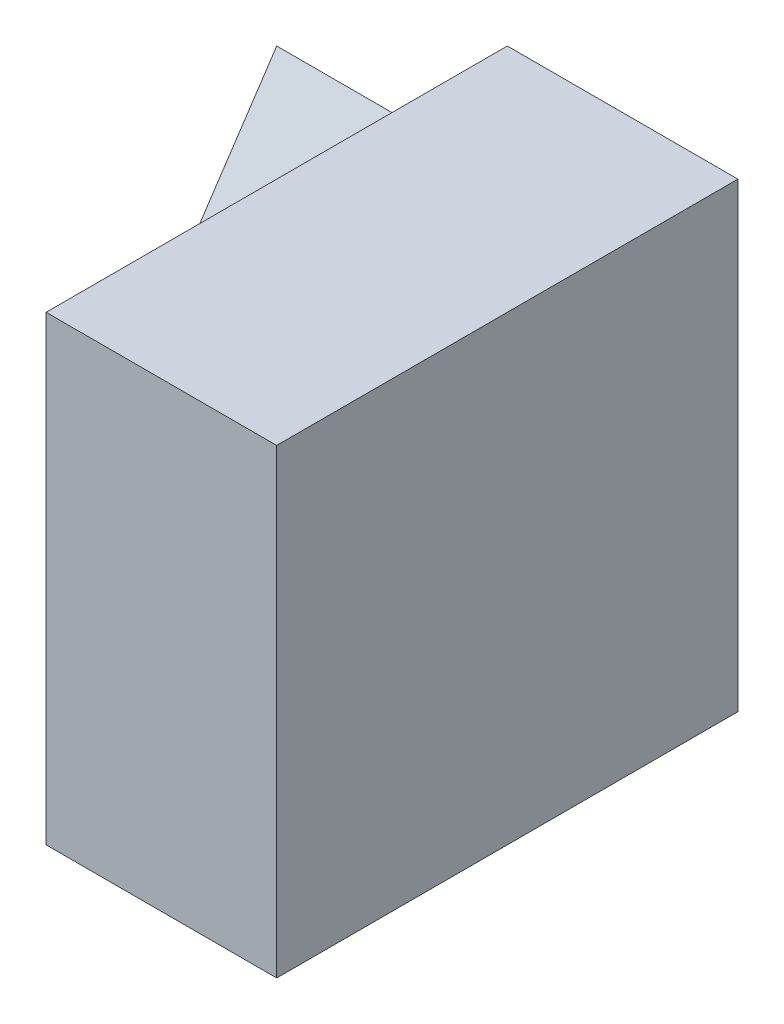
ISO-10303-21;
HEADER;
FILE_DESCRIPTION(('STEP AP214'),'2;1');
FILE_NAME('part.step','',(''),(''),'','','');
FILE_SCHEMA(('AUTOMOTIVE_DESIGN { 1 0 10303 214 1 1 1 1 }'));
ENDSEC;
DATA;
#1=APPLICATION_CONTEXT('core data for automotive mechanical design processes');
#2=APPLICATION_PROTOCOL_DEFINITION('international standard','automotive_design',2000,#1);
#3=PRODUCT_CONTEXT('',#1,'mechanical');
#4=PRODUCT('Part','Part','',(#3));
#5=PRODUCT_RELATED_PRODUCT_CATEGORY('part','',(#4));
#6=PRODUCT_DEFINITION_FORMATION('','',#4);
#7=PRODUCT_DEFINITION_CONTEXT('part definition',#1,'design');
#8=PRODUCT_DEFINITION('design','',#6,#7);
#9=PRODUCT_DEFINITION_SHAPE('','',#8);
#10=(LENGTH_UNIT() NAMED_UNIT(*) SI_UNIT(.MILLI.,.METRE.));
#11=(NAMED_UNIT(*) PLANE_ANGLE_UNIT() SI_UNIT($,.RADIAN.));
#12=(NAMED_UNIT(*) SI_UNIT($,.STERADIAN.) SOLID_ANGLE_UNIT());
#13=UNCERTAINTY_MEASURE_WITH_UNIT(LENGTH_MEASURE(1.E-05),#10,'distance_accuracy_value','');
#14=(GEOMETRIC_REPRESENTATION_CONTEXT(3) GLOBAL_UNCERTAINTY_ASSIGNED_CONTEXT((#13)) GLOBAL_UNIT_ASSIGNED_CONTEXT((#10,
#11,#12)) REPRESENTATION_CONTEXT('',''));
#15=CARTESIAN_POINT('',(0.,0.,0.));
#16=DIRECTION('',(0.,0.,1.));
#17=DIRECTION('',(1.,0.,0.));
#18=AXIS2_PLACEMENT_3D('',#15,#16,#17);
#19=CARTESIAN_POINT('',(2.,0.,0.));
#20=DIRECTION('',(0.,0.,-1.));
#21=DIRECTION('',(-1.,0.,0.));
#22=AXIS2_PLACEMENT_3D('',#19,#20,#21);
#23=PLANE('',#22);
#24=DIRECTION('',(0.,-1.,0.));
#25=VECTOR('',#24,1.);
#26=CARTESIAN_POINT('',(0.,0.,0.));
#27=LINE('',#26,#25);
#28=CARTESIAN_POINT('',(0.,4.,0.));
#29=VERTEX_POINT('',#28);
#30=CARTESIAN_POINT('',(0.,0.,0.));
#31=VERTEX_POINT('',#30);
#32=EDGE_CURVE('E105',#29,#31,#27,.T.);
#33=ORIENTED_EDGE('',*,*,#32,.T.);
#34=DIRECTION('',(-1.,0.,0.));
#35=VECTOR('',#34,1.);
#36=CARTESIAN_POINT('',(2.,0.,0.));
#37=LINE('',#36,#35);
#38=CARTESIAN_POINT('',(2.,0.,0.));
#39=VERTEX_POINT('',#38);
#40=EDGE_CURVE('E11',#39,#31,#37,.T.);
#41=ORIENTED_EDGE('',*,*,#40,.F.);
#42=DIRECTION('',(0.,-1.,0.));
#43=VECTOR('',#42,1.);
#44=CARTESIAN_POINT('',(2.,0.,0.));
#45=LINE('',#44,#43);
#46=CARTESIAN_POINT('',(2.,4.,0.));
#47=VERTEX_POINT('',#46);
#48=EDGE_CURVE('E127',#47,#39,#45,.T.);
#49=ORIENTED_EDGE('',*,*,#48,.F.);
#50=DIRECTION('',(-1.,0.,0.));
#51=VECTOR('',#50,1.);
#52=CARTESIAN_POINT('',(2.,4.,0.));
#53=LINE('',#52,#51);
#54=EDGE_CURVE('E128',#47,#29,#53,.T.);
#55=ORIENTED_EDGE('',*,*,#54,.T.);
#56=EDGE_LOOP('',(#33,#41,#49,#55));
#57=FACE_BOUND('',#56,.T.);
#58=ADVANCED_FACE('F33',(#57),#23,.F.);
#59=CARTESIAN_POINT('',(2.,0.,0.));
#60=DIRECTION('',(0.,1.,0.));
#61=DIRECTION('',(0.,0.,1.));
#62=AXIS2_PLACEMENT_3D('',#59,#60,#61);
#63=PLANE('',#62);
#64=DIRECTION('',(0.,0.,-1.));
#65=VECTOR('',#64,1.);
#66=CARTESIAN_POINT('',(0.,0.,0.));
#67=LINE('',#66,#65);
#68=CARTESIAN_POINT('',(0.,0.,-2.));
#69=VERTEX_POINT('',#68);
#70=EDGE_CURVE('E111',#31,#69,#67,.T.);
#71=ORIENTED_EDGE('',*,*,#70,.T.);
#72=DIRECTION('',(1.,0.,0.));
#73=VECTOR('',#72,1.);
#74=CARTESIAN_POINT('',(-2.,0.,-2.));
#75=LINE('',#74,#73);
#76=CARTESIAN_POINT('',(-2.,0.,-2.));
#77=VERTEX_POINT('',#76);
#78=EDGE_CURVE('E96',#77,#69,#75,.T.);
#79=ORIENTED_EDGE('',*,*,#78,.F.);
#80=DIRECTION('',(0.,0.,1.));
#81=VECTOR('',#80,1.);
#82=CARTESIAN_POINT('',(-2.,0.,-4.));
#83=LINE('',#82,#81);
#84=CARTESIAN_POINT('',(-2.,0.,-4.));
#85=VERTEX_POINT('',#84);
#86=EDGE_CURVE('E137',#85,#77,#83,.T.);
#87=ORIENTED_EDGE('',*,*,#86,.F.);
#88=DIRECTION('',(-1.,0.,0.));
#89=VECTOR('',#88,1.);
#90=CARTESIAN_POINT('',(2.,0.,-4.));
#91=LINE('',#90,#89);
#92=CARTESIAN_POINT('',(2.,0.,-4.));
#93=VERTEX_POINT('',#92);
#94=EDGE_CURVE('E42',#93,#85,#91,.T.);
#95=ORIENTED_EDGE('',*,*,#94,.F.);
#96=DIRECTION('',(0.,0.,-1.));
#97=VECTOR('',#96,1.);
#98=CARTESIAN_POINT('',(2.,0.,0.));
#99=LINE('',#98,#97);
#100=EDGE_CURVE('E79',#39,#93,#99,.T.);
#101=ORIENTED_EDGE('',*,*,#100,.F.);
#102=ORIENTED_EDGE('',*,*,#40,.T.);
#103=EDGE_LOOP('',(#71,#79,#87,#95,#101,#102));
#104=FACE_BOUND('',#103,.T.);
#105=ADVANCED_FACE('F113',(#104),#63,.F.);
#106=CARTESIAN_POINT('',(2.,0.,-4.));
#107=DIRECTION('',(0.,0.,1.));
#108=DIRECTION('',(1.,0.,0.));
#109=AXIS2_PLACEMENT_3D('',#106,#107,#108);
#110=PLANE('',#109);
#111=ORIENTED_EDGE('',*,*,#94,.T.);
#112=DIRECTION('',(0.,-1.,0.));
#113=VECTOR('',#112,1.);
#114=CARTESIAN_POINT('',(-2.,0.,-4.));
#115=LINE('',#114,#113);
#116=CARTESIAN_POINT('',(-2.,3.,-4.));
#117=VERTEX_POINT('',#116);
#118=EDGE_CURVE('E112',#117,#85,#115,.T.);
#119=ORIENTED_EDGE('',*,*,#118,.F.);
#120=DIRECTION('',(1.,0.,0.));
#121=VECTOR('',#120,1.);
#122=CARTESIAN_POINT('',(-2.,3.,-4.));
#123=LINE('',#122,#121);
#124=CARTESIAN_POINT('',(0.,3.,-4.));
#125=VERTEX_POINT('',#124);
#126=EDGE_CURVE('E106',#117,#125,#123,.T.);
#127=ORIENTED_EDGE('',*,*,#126,.T.);
#128=DIRECTION('',(0.,1.,0.));
#129=VECTOR('',#128,1.);
#130=CARTESIAN_POINT('',(0.,0.,-4.));
#131=LINE('',#130,#129);
#132=CARTESIAN_POINT('',(0.,4.,-4.));
#133=VERTEX_POINT('',#132);
#134=EDGE_CURVE('E66',#125,#133,#131,.T.);
#135=ORIENTED_EDGE('',*,*,#134,.T.);
#136=DIRECTION('',(-1.,0.,0.));
#137=VECTOR('',#136,1.);
#138=CARTESIAN_POINT('',(2.,4.,-4.));
#139=LINE('',#138,#137);
#140=CARTESIAN_POINT('',(2.,4.,-4.));
#141=VERTEX_POINT('',#140);
#142=EDGE_CURVE('E130',#141,#133,#139,.T.);
#143=ORIENTED_EDGE('',*,*,#142,.F.);
#144=DIRECTION('',(0.,1.,0.));
#145=VECTOR('',#144,1.);
#146=CARTESIAN_POINT('',(2.,0.,-4.));
#147=LINE('',#146,#145);
#148=EDGE_CURVE('E136',#93,#141,#147,.T.);
#149=ORIENTED_EDGE('',*,*,#148,.F.);
#150=EDGE_LOOP('',(#111,#119,#127,#135,#143,#149));
#151=FACE_BOUND('',#150,.T.);
#152=ADVANCED_FACE('F134',(#151),#110,.F.);
#153=CARTESIAN_POINT('',(2.,4.,0.));
#154=DIRECTION('',(0.,-1.,0.));
#155=DIRECTION('',(0.,0.,-1.));
#156=AXIS2_PLACEMENT_3D('',#153,#154,#155);
#157=PLANE('',#156);
#158=DIRECTION('',(0.,0.,1.));
#159=VECTOR('',#158,1.);
#160=CARTESIAN_POINT('',(0.,4.,0.));
#161=LINE('',#160,#159);
#162=EDGE_CURVE('E72',#133,#29,#161,.T.);
#163=ORIENTED_EDGE('',*,*,#162,.T.);
#164=ORIENTED_EDGE('',*,*,#54,.F.);
#165=DIRECTION('',(0.,0.,1.));
#166=VECTOR('',#165,1.);
#167=CARTESIAN_POINT('',(2.,4.,0.));
#168=LINE('',#167,#166);
#169=EDGE_CURVE('E51',#141,#47,#168,.T.);
#170=ORIENTED_EDGE('',*,*,#169,.F.);
#171=ORIENTED_EDGE('',*,*,#142,.T.);
#172=EDGE_LOOP('',(#163,#164,#170,#171));
#173=FACE_BOUND('',#172,.T.);
#174=ADVANCED_FACE('F147',(#173),#157,.F.);
#175=CARTESIAN_POINT('',(2.,0.,0.));
#176=DIRECTION('',(-1.,0.,0.));
#177=DIRECTION('',(0.,0.,1.));
#178=AXIS2_PLACEMENT_3D('',#175,#176,#177);
#179=PLANE('',#178);
#180=ORIENTED_EDGE('',*,*,#48,.T.);
#181=ORIENTED_EDGE('',*,*,#100,.T.);
#182=ORIENTED_EDGE('',*,*,#148,.T.);
#183=ORIENTED_EDGE('',*,*,#169,.T.);
#184=EDGE_LOOP('',(#180,#181,#182,#183));
#185=FACE_BOUND('',#184,.T.);
#186=ADVANCED_FACE('F146',(#185),#179,.F.);
#187=CARTESIAN_POINT('',(0.,0.,0.));
#188=DIRECTION('',(-1.,0.,0.));
#189=DIRECTION('',(0.,0.,1.));
#190=AXIS2_PLACEMENT_3D('',#187,#188,#189);
#191=PLANE('',#190);
#192=ORIENTED_EDGE('',*,*,#134,.F.);
#193=DIRECTION('',(0.,-0.832050294337844,0.554700196225229));
#194=VECTOR('',#193,1.);
#195=CARTESIAN_POINT('',(0.,0.,-2.));
#196=LINE('',#195,#194);
#197=EDGE_CURVE('E99',#125,#69,#196,.T.);
#198=ORIENTED_EDGE('',*,*,#197,.T.);
#199=ORIENTED_EDGE('',*,*,#70,.F.);
#200=ORIENTED_EDGE('',*,*,#32,.F.);
#201=ORIENTED_EDGE('',*,*,#162,.F.);
#202=EDGE_LOOP('',(#192,#198,#199,#200,#201));
#203=FACE_BOUND('',#202,.T.);
#204=ADVANCED_FACE('F109',(#203),#191,.T.);
#205=CARTESIAN_POINT('',(-2.,0.,0.));
#206=DIRECTION('',(1.,0.,0.));
#207=DIRECTION('',(0.,0.,-1.));
#208=AXIS2_PLACEMENT_3D('',#205,#206,#207);
#209=PLANE('',#208);
#210=ORIENTED_EDGE('',*,*,#86,.T.);
#211=DIRECTION('',(0.,-0.832050294337844,0.554700196225229));
#212=VECTOR('',#211,1.);
#213=CARTESIAN_POINT('',(-2.,0.,-2.));
#214=LINE('',#213,#212);
#215=EDGE_CURVE('E101',#117,#77,#214,.T.);
#216=ORIENTED_EDGE('',*,*,#215,.F.);
#217=ORIENTED_EDGE('',*,*,#118,.T.);
#218=EDGE_LOOP('',(#210,#216,#217));
#219=FACE_BOUND('',#218,.T.);
#220=ADVANCED_FACE('F140',(#219),#209,.F.);
#221=CARTESIAN_POINT('',(0.,0.,-2.));
#222=DIRECTION('',(0.,-0.554700196225229,-0.832050294337844));
#223=DIRECTION('',(0.,0.832050294337844,-0.554700196225229));
#224=AXIS2_PLACEMENT_3D('',#221,#222,#223);
#225=PLANE('',#224);
#226=ORIENTED_EDGE('',*,*,#215,.T.);
#227=ORIENTED_EDGE('',*,*,#78,.T.);
#228=ORIENTED_EDGE('',*,*,#197,.F.);
#229=ORIENTED_EDGE('',*,*,#126,.F.);
#230=EDGE_LOOP('',(#226,#227,#228,#229));
#231=FACE_BOUND('',#230,.T.);
#232=ADVANCED_FACE('F98',(#231),#225,.F.);
#233=CLOSED_SHELL('',(#58,#105,#152,#174,#186,#204,#220,#232));
#234=MANIFOLD_SOLID_BREP('B2',#233);
#235=ADVANCED_BREP_SHAPE_REPRESENTATION('',(#18,#234),#14);
#236=SHAPE_DEFINITION_REPRESENTATION(#9,#235);
ENDSEC;
END-ISO-10303-21;
